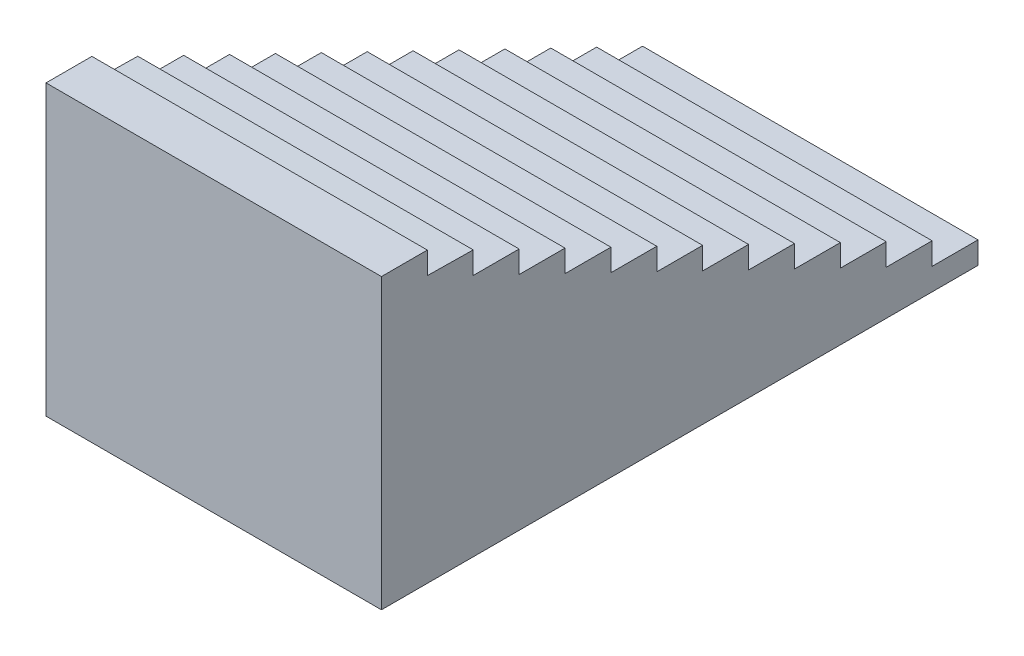
ISO-10303-21;
HEADER;
FILE_DESCRIPTION(('STEP AP214'),'2;1');
FILE_NAME('part.step','',(''),(''),'','','');
FILE_SCHEMA(('AUTOMOTIVE_DESIGN { 1 0 10303 214 1 1 1 1 }'));
ENDSEC;
DATA;
#1=APPLICATION_CONTEXT('core data for automotive mechanical design processes');
#2=APPLICATION_PROTOCOL_DEFINITION('international standard','automotive_design',2000,#1);
#3=PRODUCT_CONTEXT('',#1,'mechanical');
#4=PRODUCT('Part','Part','',(#3));
#5=PRODUCT_RELATED_PRODUCT_CATEGORY('part','',(#4));
#6=PRODUCT_DEFINITION_FORMATION('','',#4);
#7=PRODUCT_DEFINITION_CONTEXT('part definition',#1,'design');
#8=PRODUCT_DEFINITION('design','',#6,#7);
#9=PRODUCT_DEFINITION_SHAPE('','',#8);
#10=(LENGTH_UNIT() NAMED_UNIT(*) SI_UNIT(.MILLI.,.METRE.));
#11=(NAMED_UNIT(*) PLANE_ANGLE_UNIT() SI_UNIT($,.RADIAN.));
#12=(NAMED_UNIT(*) SI_UNIT($,.STERADIAN.) SOLID_ANGLE_UNIT());
#13=UNCERTAINTY_MEASURE_WITH_UNIT(LENGTH_MEASURE(1.E-05),#10,'distance_accuracy_value','');
#14=(GEOMETRIC_REPRESENTATION_CONTEXT(3) GLOBAL_UNCERTAINTY_ASSIGNED_CONTEXT((#13)) GLOBAL_UNIT_ASSIGNED_CONTEXT((#10,
#11,#12)) REPRESENTATION_CONTEXT('',''));
#15=CARTESIAN_POINT('',(0.,0.,0.));
#16=DIRECTION('',(0.,0.,1.));
#17=DIRECTION('',(1.,0.,0.));
#18=AXIS2_PLACEMENT_3D('',#15,#16,#17);
#19=CARTESIAN_POINT('',(-2120.,195.213145770368,60.));
#20=DIRECTION('',(0.,0.,-1.));
#21=DIRECTION('',(0.,1.,0.));
#22=AXIS2_PLACEMENT_3D('',#19,#20,#21);
#23=PLANE('',#22);
#24=DIRECTION('',(0.,1.,0.));
#25=VECTOR('',#24,1.);
#26=CARTESIAN_POINT('',(0.,195.213145770368,60.));
#27=LINE('',#26,#25);
#28=CARTESIAN_POINT('',(0.,55.2131457703675,60.));
#29=VERTEX_POINT('',#28);
#30=CARTESIAN_POINT('',(0.,195.213145770368,60.));
#31=VERTEX_POINT('',#30);
#32=EDGE_CURVE('E262',#29,#31,#27,.T.);
#33=ORIENTED_EDGE('',*,*,#32,.F.);
#34=DIRECTION('',(1.,0.,0.));
#35=VECTOR('',#34,1.);
#36=CARTESIAN_POINT('',(-2120.,55.2131457703675,60.));
#37=LINE('',#36,#35);
#38=CARTESIAN_POINT('',(-2120.,55.2131457703675,60.));
#39=VERTEX_POINT('',#38);
#40=EDGE_CURVE('E11',#39,#29,#37,.T.);
#41=ORIENTED_EDGE('',*,*,#40,.F.);
#42=DIRECTION('',(0.,1.,0.));
#43=VECTOR('',#42,1.);
#44=CARTESIAN_POINT('',(-2120.,195.213145770368,60.));
#45=LINE('',#44,#43);
#46=CARTESIAN_POINT('',(-2120.,195.213145770368,60.));
#47=VERTEX_POINT('',#46);
#48=EDGE_CURVE('E370',#39,#47,#45,.T.);
#49=ORIENTED_EDGE('',*,*,#48,.T.);
#50=DIRECTION('',(1.,0.,0.));
#51=VECTOR('',#50,1.);
#52=CARTESIAN_POINT('',(-2120.,195.213145770368,60.));
#53=LINE('',#52,#51);
#54=EDGE_CURVE('E42',#47,#31,#53,.T.);
#55=ORIENTED_EDGE('',*,*,#54,.T.);
#56=EDGE_LOOP('',(#33,#41,#49,#55));
#57=FACE_BOUND('',#56,.T.);
#58=ADVANCED_FACE('F39',(#57),#23,.T.);
#59=CARTESIAN_POINT('',(-2120.,55.2131457703675,60.));
#60=DIRECTION('',(0.,0.99989905724305,-0.0142082836563894));
#61=DIRECTION('',(0.,0.0142082836563894,0.99989905724305));
#62=AXIS2_PLACEMENT_3D('',#59,#60,#61);
#63=PLANE('',#62);
#64=DIRECTION('',(0.,0.0142082836563894,0.99989905724305));
#65=VECTOR('',#64,1.);
#66=CARTESIAN_POINT('',(0.,55.2131457703675,60.));
#67=LINE('',#66,#65);
#68=CARTESIAN_POINT('',(0.,51.0927435100146,-229.970726600484));
#69=VERTEX_POINT('',#68);
#70=EDGE_CURVE('E367',#69,#29,#67,.T.);
#71=ORIENTED_EDGE('',*,*,#70,.F.);
#72=DIRECTION('',(1.,0.,0.));
#73=VECTOR('',#72,1.);
#74=CARTESIAN_POINT('',(-2120.,51.0927435100146,-229.970726600484));
#75=LINE('',#74,#73);
#76=CARTESIAN_POINT('',(-2120.,51.0927435100146,-229.970726600484));
#77=VERTEX_POINT('',#76);
#78=EDGE_CURVE('E49',#77,#69,#75,.T.);
#79=ORIENTED_EDGE('',*,*,#78,.F.);
#80=DIRECTION('',(0.,0.0142082836563894,0.99989905724305));
#81=VECTOR('',#80,1.);
#82=CARTESIAN_POINT('',(-2120.,55.2131457703675,60.));
#83=LINE('',#82,#81);
#84=EDGE_CURVE('E248',#77,#39,#83,.T.);
#85=ORIENTED_EDGE('',*,*,#84,.T.);
#86=ORIENTED_EDGE('',*,*,#40,.T.);
#87=EDGE_LOOP('',(#71,#79,#85,#86));
#88=FACE_BOUND('',#87,.T.);
#89=ADVANCED_FACE('F448',(#88),#63,.T.);
#90=CARTESIAN_POINT('',(-2120.,51.0927435100146,-229.970726600484));
#91=DIRECTION('',(0.,0.,-1.));
#92=DIRECTION('',(0.,1.,0.));
#93=AXIS2_PLACEMENT_3D('',#90,#91,#92);
#94=PLANE('',#93);
#95=DIRECTION('',(0.,1.,0.));
#96=VECTOR('',#95,1.);
#97=CARTESIAN_POINT('',(0.,51.0927435100146,-229.970726600484));
#98=LINE('',#97,#96);
#99=CARTESIAN_POINT('',(0.,-88.9072564899854,-229.970726600484));
#100=VERTEX_POINT('',#99);
#101=EDGE_CURVE('E234',#100,#69,#98,.T.);
#102=ORIENTED_EDGE('',*,*,#101,.F.);
#103=DIRECTION('',(1.,0.,0.));
#104=VECTOR('',#103,1.);
#105=CARTESIAN_POINT('',(-2120.,-88.9072564899854,-229.970726600484));
#106=LINE('',#105,#104);
#107=CARTESIAN_POINT('',(-2120.,-88.9072564899854,-229.970726600484));
#108=VERTEX_POINT('',#107);
#109=EDGE_CURVE('E229',#108,#100,#106,.T.);
#110=ORIENTED_EDGE('',*,*,#109,.F.);
#111=DIRECTION('',(0.,1.,0.));
#112=VECTOR('',#111,1.);
#113=CARTESIAN_POINT('',(-2120.,51.0927435100146,-229.970726600484));
#114=LINE('',#113,#112);
#115=EDGE_CURVE('E232',#108,#77,#114,.T.);
#116=ORIENTED_EDGE('',*,*,#115,.T.);
#117=ORIENTED_EDGE('',*,*,#78,.T.);
#118=EDGE_LOOP('',(#102,#110,#116,#117));
#119=FACE_BOUND('',#118,.T.);
#120=ADVANCED_FACE('F231',(#119),#94,.T.);
#121=CARTESIAN_POINT('',(-2120.,-88.9072564899854,-229.970726600484));
#122=DIRECTION('',(0.,1.,0.));
#123=DIRECTION('',(0.,0.,1.));
#124=AXIS2_PLACEMENT_3D('',#121,#122,#123);
#125=PLANE('',#124);
#126=DIRECTION('',(0.,0.,1.));
#127=VECTOR('',#126,1.);
#128=CARTESIAN_POINT('',(0.,-88.9072564899854,-229.970726600484));
#129=LINE('',#128,#127);
#130=CARTESIAN_POINT('',(0.,-88.9072564899854,-519.970726600484));
#131=VERTEX_POINT('',#130);
#132=EDGE_CURVE('E362',#131,#100,#129,.T.);
#133=ORIENTED_EDGE('',*,*,#132,.F.);
#134=DIRECTION('',(1.,0.,0.));
#135=VECTOR('',#134,1.);
#136=CARTESIAN_POINT('',(-2120.,-88.9072564899854,-519.970726600484));
#137=LINE('',#136,#135);
#138=CARTESIAN_POINT('',(-2120.,-88.9072564899854,-519.970726600484));
#139=VERTEX_POINT('',#138);
#140=EDGE_CURVE('E240',#139,#131,#137,.T.);
#141=ORIENTED_EDGE('',*,*,#140,.F.);
#142=DIRECTION('',(0.,0.,1.));
#143=VECTOR('',#142,1.);
#144=CARTESIAN_POINT('',(-2120.,-88.9072564899854,-229.970726600484));
#145=LINE('',#144,#143);
#146=EDGE_CURVE('E246',#139,#108,#145,.T.);
#147=ORIENTED_EDGE('',*,*,#146,.T.);
#148=ORIENTED_EDGE('',*,*,#109,.T.);
#149=EDGE_LOOP('',(#133,#141,#147,#148));
#150=FACE_BOUND('',#149,.T.);
#151=ADVANCED_FACE('F251',(#150),#125,.T.);
#152=CARTESIAN_POINT('',(-2120.,-88.9072564899854,-519.970726600484));
#153=DIRECTION('',(0.,0.,-1.));
#154=DIRECTION('',(-1.,0.,0.));
#155=AXIS2_PLACEMENT_3D('',#152,#153,#154);
#156=PLANE('',#155);
#157=DIRECTION('',(0.,1.,0.));
#158=VECTOR('',#157,1.);
#159=CARTESIAN_POINT('',(0.,-88.9072564899854,-519.970726600484));
#160=LINE('',#159,#158);
#161=CARTESIAN_POINT('',(0.,-228.907256489985,-519.970726600484));
#162=VERTEX_POINT('',#161);
#163=EDGE_CURVE('E358',#162,#131,#160,.T.);
#164=ORIENTED_EDGE('',*,*,#163,.F.);
#165=DIRECTION('',(1.,0.,0.));
#166=VECTOR('',#165,1.);
#167=CARTESIAN_POINT('',(-2120.,-228.907256489985,-519.970726600484));
#168=LINE('',#167,#166);
#169=CARTESIAN_POINT('',(-2120.,-228.907256489985,-519.970726600484));
#170=VERTEX_POINT('',#169);
#171=EDGE_CURVE('E376',#170,#162,#168,.T.);
#172=ORIENTED_EDGE('',*,*,#171,.F.);
#173=DIRECTION('',(0.,1.,0.));
#174=VECTOR('',#173,1.);
#175=CARTESIAN_POINT('',(-2120.,-88.9072564899854,-519.970726600484));
#176=LINE('',#175,#174);
#177=EDGE_CURVE('E253',#170,#139,#176,.T.);
#178=ORIENTED_EDGE('',*,*,#177,.T.);
#179=ORIENTED_EDGE('',*,*,#140,.T.);
#180=EDGE_LOOP('',(#164,#172,#178,#179));
#181=FACE_BOUND('',#180,.T.);
#182=ADVANCED_FACE('F461',(#181),#156,.T.);
#183=CARTESIAN_POINT('',(-2120.,-228.907256489985,-519.970726600484));
#184=DIRECTION('',(0.,1.,0.));
#185=DIRECTION('',(0.,0.,1.));
#186=AXIS2_PLACEMENT_3D('',#183,#184,#185);
#187=PLANE('',#186);
#188=DIRECTION('',(0.,0.,1.));
#189=VECTOR('',#188,1.);
#190=CARTESIAN_POINT('',(0.,-228.907256489985,-519.970726600484));
#191=LINE('',#190,#189);
#192=CARTESIAN_POINT('',(0.,-228.907256489985,-809.970726600485));
#193=VERTEX_POINT('',#192);
#194=EDGE_CURVE('E354',#193,#162,#191,.T.);
#195=ORIENTED_EDGE('',*,*,#194,.F.);
#196=DIRECTION('',(1.,0.,0.));
#197=VECTOR('',#196,1.);
#198=CARTESIAN_POINT('',(-2120.,-228.907256489985,-809.970726600485));
#199=LINE('',#198,#197);
#200=CARTESIAN_POINT('',(-2120.,-228.907256489985,-809.970726600485));
#201=VERTEX_POINT('',#200);
#202=EDGE_CURVE('E379',#201,#193,#199,.T.);
#203=ORIENTED_EDGE('',*,*,#202,.F.);
#204=DIRECTION('',(0.,0.,1.));
#205=VECTOR('',#204,1.);
#206=CARTESIAN_POINT('',(-2120.,-228.907256489985,-519.970726600484));
#207=LINE('',#206,#205);
#208=EDGE_CURVE('E256',#201,#170,#207,.T.);
#209=ORIENTED_EDGE('',*,*,#208,.T.);
#210=ORIENTED_EDGE('',*,*,#171,.T.);
#211=EDGE_LOOP('',(#195,#203,#209,#210));
#212=FACE_BOUND('',#211,.T.);
#213=ADVANCED_FACE('F464',(#212),#187,.T.);
#214=CARTESIAN_POINT('',(-2120.,-228.907256489985,-809.970726600485));
#215=DIRECTION('',(0.,0.,-1.));
#216=DIRECTION('',(0.,1.,0.));
#217=AXIS2_PLACEMENT_3D('',#214,#215,#216);
#218=PLANE('',#217);
#219=DIRECTION('',(0.,1.,0.));
#220=VECTOR('',#219,1.);
#221=CARTESIAN_POINT('',(0.,-228.907256489985,-809.970726600485));
#222=LINE('',#221,#220);
#223=CARTESIAN_POINT('',(0.,-368.907256489985,-809.970726600484));
#224=VERTEX_POINT('',#223);
#225=EDGE_CURVE('E350',#224,#193,#222,.T.);
#226=ORIENTED_EDGE('',*,*,#225,.F.);
#227=DIRECTION('',(1.,0.,0.));
#228=VECTOR('',#227,1.);
#229=CARTESIAN_POINT('',(-2120.,-368.907256489985,-809.970726600484));
#230=LINE('',#229,#228);
#231=CARTESIAN_POINT('',(-2120.,-368.907256489985,-809.970726600484));
#232=VERTEX_POINT('',#231);
#233=EDGE_CURVE('E382',#232,#224,#230,.T.);
#234=ORIENTED_EDGE('',*,*,#233,.F.);
#235=DIRECTION('',(0.,1.,0.));
#236=VECTOR('',#235,1.);
#237=CARTESIAN_POINT('',(-2120.,-228.907256489985,-809.970726600485));
#238=LINE('',#237,#236);
#239=EDGE_CURVE('E809',#232,#201,#238,.T.);
#240=ORIENTED_EDGE('',*,*,#239,.T.);
#241=ORIENTED_EDGE('',*,*,#202,.T.);
#242=EDGE_LOOP('',(#226,#234,#240,#241));
#243=FACE_BOUND('',#242,.T.);
#244=ADVANCED_FACE('F468',(#243),#218,.T.);
#245=CARTESIAN_POINT('',(-2120.,-368.907256489985,-809.970726600484));
#246=DIRECTION('',(0.,1.,0.));
#247=DIRECTION('',(0.,0.,1.));
#248=AXIS2_PLACEMENT_3D('',#245,#246,#247);
#249=PLANE('',#248);
#250=DIRECTION('',(0.,0.,1.));
#251=VECTOR('',#250,1.);
#252=CARTESIAN_POINT('',(0.,-368.907256489985,-809.970726600484));
#253=LINE('',#252,#251);
#254=CARTESIAN_POINT('',(0.,-368.907256489985,-1099.97072660048));
#255=VERTEX_POINT('',#254);
#256=EDGE_CURVE('E346',#255,#224,#253,.T.);
#257=ORIENTED_EDGE('',*,*,#256,.F.);
#258=DIRECTION('',(1.,0.,0.));
#259=VECTOR('',#258,1.);
#260=CARTESIAN_POINT('',(-2120.,-368.907256489985,-1099.97072660048));
#261=LINE('',#260,#259);
#262=CARTESIAN_POINT('',(-2120.,-368.907256489985,-1099.97072660048));
#263=VERTEX_POINT('',#262);
#264=EDGE_CURVE('E385',#263,#255,#261,.T.);
#265=ORIENTED_EDGE('',*,*,#264,.F.);
#266=DIRECTION('',(0.,0.,1.));
#267=VECTOR('',#266,1.);
#268=CARTESIAN_POINT('',(-2120.,-368.907256489985,-809.970726600484));
#269=LINE('',#268,#267);
#270=EDGE_CURVE('E805',#263,#232,#269,.T.);
#271=ORIENTED_EDGE('',*,*,#270,.T.);
#272=ORIENTED_EDGE('',*,*,#233,.T.);
#273=EDGE_LOOP('',(#257,#265,#271,#272));
#274=FACE_BOUND('',#273,.T.);
#275=ADVANCED_FACE('F472',(#274),#249,.T.);
#276=CARTESIAN_POINT('',(-2120.,-368.907256489985,-1099.97072660048));
#277=DIRECTION('',(0.,0.,-1.));
#278=DIRECTION('',(-1.,0.,0.));
#279=AXIS2_PLACEMENT_3D('',#276,#277,#278);
#280=PLANE('',#279);
#281=DIRECTION('',(0.,1.,0.));
#282=VECTOR('',#281,1.);
#283=CARTESIAN_POINT('',(0.,-368.907256489985,-1099.97072660048));
#284=LINE('',#283,#282);
#285=CARTESIAN_POINT('',(0.,-508.907256489985,-1099.97072660048));
#286=VERTEX_POINT('',#285);
#287=EDGE_CURVE('E342',#286,#255,#284,.T.);
#288=ORIENTED_EDGE('',*,*,#287,.F.);
#289=DIRECTION('',(1.,0.,0.));
#290=VECTOR('',#289,1.);
#291=CARTESIAN_POINT('',(-2120.,-508.907256489985,-1099.97072660048));
#292=LINE('',#291,#290);
#293=CARTESIAN_POINT('',(-2120.,-508.907256489985,-1099.97072660048));
#294=VERTEX_POINT('',#293);
#295=EDGE_CURVE('E388',#294,#286,#292,.T.);
#296=ORIENTED_EDGE('',*,*,#295,.F.);
#297=DIRECTION('',(0.,1.,0.));
#298=VECTOR('',#297,1.);
#299=CARTESIAN_POINT('',(-2120.,-368.907256489985,-1099.97072660048));
#300=LINE('',#299,#298);
#301=EDGE_CURVE('E819',#294,#263,#300,.T.);
#302=ORIENTED_EDGE('',*,*,#301,.T.);
#303=ORIENTED_EDGE('',*,*,#264,.T.);
#304=EDGE_LOOP('',(#288,#296,#302,#303));
#305=FACE_BOUND('',#304,.T.);
#306=ADVANCED_FACE('F476',(#305),#280,.T.);
#307=CARTESIAN_POINT('',(-2120.,-508.907256489985,-1099.97072660048));
#308=DIRECTION('',(0.,1.,0.));
#309=DIRECTION('',(0.,0.,1.));
#310=AXIS2_PLACEMENT_3D('',#307,#308,#309);
#311=PLANE('',#310);
#312=DIRECTION('',(0.,0.,1.));
#313=VECTOR('',#312,1.);
#314=CARTESIAN_POINT('',(0.,-508.907256489985,-1099.97072660048));
#315=LINE('',#314,#313);
#316=CARTESIAN_POINT('',(0.,-508.907256489985,-1389.97072660048));
#317=VERTEX_POINT('',#316);
#318=EDGE_CURVE('E338',#317,#286,#315,.T.);
#319=ORIENTED_EDGE('',*,*,#318,.F.);
#320=DIRECTION('',(1.,0.,0.));
#321=VECTOR('',#320,1.);
#322=CARTESIAN_POINT('',(-2120.,-508.907256489985,-1389.97072660048));
#323=LINE('',#322,#321);
#324=CARTESIAN_POINT('',(-2120.,-508.907256489985,-1389.97072660048));
#325=VERTEX_POINT('',#324);
#326=EDGE_CURVE('E391',#325,#317,#323,.T.);
#327=ORIENTED_EDGE('',*,*,#326,.F.);
#328=DIRECTION('',(0.,0.,1.));
#329=VECTOR('',#328,1.);
#330=CARTESIAN_POINT('',(-2120.,-508.907256489985,-1099.97072660048));
#331=LINE('',#330,#329);
#332=EDGE_CURVE('E798',#325,#294,#331,.T.);
#333=ORIENTED_EDGE('',*,*,#332,.T.);
#334=ORIENTED_EDGE('',*,*,#295,.T.);
#335=EDGE_LOOP('',(#319,#327,#333,#334));
#336=FACE_BOUND('',#335,.T.);
#337=ADVANCED_FACE('F480',(#336),#311,.T.);
#338=CARTESIAN_POINT('',(-2120.,-508.907256489985,-1389.97072660048));
#339=DIRECTION('',(0.,0.,-1.));
#340=DIRECTION('',(0.,1.,0.));
#341=AXIS2_PLACEMENT_3D('',#338,#339,#340);
#342=PLANE('',#341);
#343=DIRECTION('',(0.,1.,0.));
#344=VECTOR('',#343,1.);
#345=CARTESIAN_POINT('',(0.,-508.907256489985,-1389.97072660048));
#346=LINE('',#345,#344);
#347=CARTESIAN_POINT('',(0.,-648.907256489985,-1389.97072660048));
#348=VERTEX_POINT('',#347);
#349=EDGE_CURVE('E334',#348,#317,#346,.T.);
#350=ORIENTED_EDGE('',*,*,#349,.F.);
#351=DIRECTION('',(1.,0.,0.));
#352=VECTOR('',#351,1.);
#353=CARTESIAN_POINT('',(-2120.,-648.907256489985,-1389.97072660048));
#354=LINE('',#353,#352);
#355=CARTESIAN_POINT('',(-2120.,-648.907256489985,-1389.97072660048));
#356=VERTEX_POINT('',#355);
#357=EDGE_CURVE('E394',#356,#348,#354,.T.);
#358=ORIENTED_EDGE('',*,*,#357,.F.);
#359=DIRECTION('',(0.,1.,0.));
#360=VECTOR('',#359,1.);
#361=CARTESIAN_POINT('',(-2120.,-508.907256489985,-1389.97072660048));
#362=LINE('',#361,#360);
#363=EDGE_CURVE('E794',#356,#325,#362,.T.);
#364=ORIENTED_EDGE('',*,*,#363,.T.);
#365=ORIENTED_EDGE('',*,*,#326,.T.);
#366=EDGE_LOOP('',(#350,#358,#364,#365));
#367=FACE_BOUND('',#366,.T.);
#368=ADVANCED_FACE('F484',(#367),#342,.T.);
#369=CARTESIAN_POINT('',(-2120.,-648.907256489985,-1389.97072660048));
#370=DIRECTION('',(0.,1.,0.));
#371=DIRECTION('',(0.,0.,1.));
#372=AXIS2_PLACEMENT_3D('',#369,#370,#371);
#373=PLANE('',#372);
#374=DIRECTION('',(0.,0.,1.));
#375=VECTOR('',#374,1.);
#376=CARTESIAN_POINT('',(0.,-648.907256489985,-1389.97072660048));
#377=LINE('',#376,#375);
#378=CARTESIAN_POINT('',(0.,-648.907256489985,-1679.97072660048));
#379=VERTEX_POINT('',#378);
#380=EDGE_CURVE('E330',#379,#348,#377,.T.);
#381=ORIENTED_EDGE('',*,*,#380,.F.);
#382=DIRECTION('',(1.,0.,0.));
#383=VECTOR('',#382,1.);
#384=CARTESIAN_POINT('',(-2120.,-648.907256489985,-1679.97072660048));
#385=LINE('',#384,#383);
#386=CARTESIAN_POINT('',(-2120.,-648.907256489985,-1679.97072660048));
#387=VERTEX_POINT('',#386);
#388=EDGE_CURVE('E397',#387,#379,#385,.T.);
#389=ORIENTED_EDGE('',*,*,#388,.F.);
#390=DIRECTION('',(0.,0.,1.));
#391=VECTOR('',#390,1.);
#392=CARTESIAN_POINT('',(-2120.,-648.907256489985,-1389.97072660048));
#393=LINE('',#392,#391);
#394=EDGE_CURVE('E826',#387,#356,#393,.T.);
#395=ORIENTED_EDGE('',*,*,#394,.T.);
#396=ORIENTED_EDGE('',*,*,#357,.T.);
#397=EDGE_LOOP('',(#381,#389,#395,#396));
#398=FACE_BOUND('',#397,.T.);
#399=ADVANCED_FACE('F488',(#398),#373,.T.);
#400=CARTESIAN_POINT('',(-2120.,-648.907256489985,-1679.97072660048));
#401=DIRECTION('',(0.,0.,-1.));
#402=DIRECTION('',(-1.,0.,0.));
#403=AXIS2_PLACEMENT_3D('',#400,#401,#402);
#404=PLANE('',#403);
#405=DIRECTION('',(0.,1.,0.));
#406=VECTOR('',#405,1.);
#407=CARTESIAN_POINT('',(0.,-648.907256489985,-1679.97072660048));
#408=LINE('',#407,#406);
#409=CARTESIAN_POINT('',(0.,-788.907256489985,-1679.97072660048));
#410=VERTEX_POINT('',#409);
#411=EDGE_CURVE('E326',#410,#379,#408,.T.);
#412=ORIENTED_EDGE('',*,*,#411,.F.);
#413=DIRECTION('',(1.,0.,0.));
#414=VECTOR('',#413,1.);
#415=CARTESIAN_POINT('',(-2120.,-788.907256489985,-1679.97072660048));
#416=LINE('',#415,#414);
#417=CARTESIAN_POINT('',(-2120.,-788.907256489985,-1679.97072660048));
#418=VERTEX_POINT('',#417);
#419=EDGE_CURVE('E400',#418,#410,#416,.T.);
#420=ORIENTED_EDGE('',*,*,#419,.F.);
#421=DIRECTION('',(0.,1.,0.));
#422=VECTOR('',#421,1.);
#423=CARTESIAN_POINT('',(-2120.,-648.907256489985,-1679.97072660048));
#424=LINE('',#423,#422);
#425=EDGE_CURVE('E787',#418,#387,#424,.T.);
#426=ORIENTED_EDGE('',*,*,#425,.T.);
#427=ORIENTED_EDGE('',*,*,#388,.T.);
#428=EDGE_LOOP('',(#412,#420,#426,#427));
#429=FACE_BOUND('',#428,.T.);
#430=ADVANCED_FACE('F492',(#429),#404,.T.);
#431=CARTESIAN_POINT('',(-2120.,-788.907256489985,-1679.97072660048));
#432=DIRECTION('',(0.,1.,0.));
#433=DIRECTION('',(0.,0.,1.));
#434=AXIS2_PLACEMENT_3D('',#431,#432,#433);
#435=PLANE('',#434);
#436=DIRECTION('',(0.,0.,1.));
#437=VECTOR('',#436,1.);
#438=CARTESIAN_POINT('',(0.,-788.907256489985,-1679.97072660048));
#439=LINE('',#438,#437);
#440=CARTESIAN_POINT('',(0.,-788.907256489985,-1969.97072660048));
#441=VERTEX_POINT('',#440);
#442=EDGE_CURVE('E322',#441,#410,#439,.T.);
#443=ORIENTED_EDGE('',*,*,#442,.F.);
#444=DIRECTION('',(1.,0.,0.));
#445=VECTOR('',#444,1.);
#446=CARTESIAN_POINT('',(-2120.,-788.907256489985,-1969.97072660048));
#447=LINE('',#446,#445);
#448=CARTESIAN_POINT('',(-2120.,-788.907256489985,-1969.97072660048));
#449=VERTEX_POINT('',#448);
#450=EDGE_CURVE('E403',#449,#441,#447,.T.);
#451=ORIENTED_EDGE('',*,*,#450,.F.);
#452=DIRECTION('',(0.,0.,1.));
#453=VECTOR('',#452,1.);
#454=CARTESIAN_POINT('',(-2120.,-788.907256489985,-1679.97072660048));
#455=LINE('',#454,#453);
#456=EDGE_CURVE('E783',#449,#418,#455,.T.);
#457=ORIENTED_EDGE('',*,*,#456,.T.);
#458=ORIENTED_EDGE('',*,*,#419,.T.);
#459=EDGE_LOOP('',(#443,#451,#457,#458));
#460=FACE_BOUND('',#459,.T.);
#461=ADVANCED_FACE('F496',(#460),#435,.T.);
#462=CARTESIAN_POINT('',(-2120.,-788.907256489985,-1969.97072660048));
#463=DIRECTION('',(0.,0.,-1.));
#464=DIRECTION('',(0.,1.,0.));
#465=AXIS2_PLACEMENT_3D('',#462,#463,#464);
#466=PLANE('',#465);
#467=DIRECTION('',(0.,1.,0.));
#468=VECTOR('',#467,1.);
#469=CARTESIAN_POINT('',(0.,-788.907256489985,-1969.97072660048));
#470=LINE('',#469,#468);
#471=CARTESIAN_POINT('',(0.,-928.907256489985,-1969.97072660048));
#472=VERTEX_POINT('',#471);
#473=EDGE_CURVE('E318',#472,#441,#470,.T.);
#474=ORIENTED_EDGE('',*,*,#473,.F.);
#475=DIRECTION('',(1.,0.,0.));
#476=VECTOR('',#475,1.);
#477=CARTESIAN_POINT('',(-2120.,-928.907256489985,-1969.97072660048));
#478=LINE('',#477,#476);
#479=CARTESIAN_POINT('',(-2120.,-928.907256489985,-1969.97072660048));
#480=VERTEX_POINT('',#479);
#481=EDGE_CURVE('E406',#480,#472,#478,.T.);
#482=ORIENTED_EDGE('',*,*,#481,.F.);
#483=DIRECTION('',(0.,1.,0.));
#484=VECTOR('',#483,1.);
#485=CARTESIAN_POINT('',(-2120.,-788.907256489985,-1969.97072660048));
#486=LINE('',#485,#484);
#487=EDGE_CURVE('E833',#480,#449,#486,.T.);
#488=ORIENTED_EDGE('',*,*,#487,.T.);
#489=ORIENTED_EDGE('',*,*,#450,.T.);
#490=EDGE_LOOP('',(#474,#482,#488,#489));
#491=FACE_BOUND('',#490,.T.);
#492=ADVANCED_FACE('F500',(#491),#466,.T.);
#493=CARTESIAN_POINT('',(-2120.,-928.907256489985,-1969.97072660048));
#494=DIRECTION('',(0.,1.,0.));
#495=DIRECTION('',(0.,0.,1.));
#496=AXIS2_PLACEMENT_3D('',#493,#494,#495);
#497=PLANE('',#496);
#498=DIRECTION('',(0.,0.,1.));
#499=VECTOR('',#498,1.);
#500=CARTESIAN_POINT('',(0.,-928.907256489985,-1969.97072660048));
#501=LINE('',#500,#499);
#502=CARTESIAN_POINT('',(0.,-928.907256489985,-2259.97072660048));
#503=VERTEX_POINT('',#502);
#504=EDGE_CURVE('E314',#503,#472,#501,.T.);
#505=ORIENTED_EDGE('',*,*,#504,.F.);
#506=DIRECTION('',(1.,0.,0.));
#507=VECTOR('',#506,1.);
#508=CARTESIAN_POINT('',(-2120.,-928.907256489985,-2259.97072660048));
#509=LINE('',#508,#507);
#510=CARTESIAN_POINT('',(-2120.,-928.907256489985,-2259.97072660048));
#511=VERTEX_POINT('',#510);
#512=EDGE_CURVE('E409',#511,#503,#509,.T.);
#513=ORIENTED_EDGE('',*,*,#512,.F.);
#514=DIRECTION('',(0.,0.,1.));
#515=VECTOR('',#514,1.);
#516=CARTESIAN_POINT('',(-2120.,-928.907256489985,-1969.97072660048));
#517=LINE('',#516,#515);
#518=EDGE_CURVE('E776',#511,#480,#517,.T.);
#519=ORIENTED_EDGE('',*,*,#518,.T.);
#520=ORIENTED_EDGE('',*,*,#481,.T.);
#521=EDGE_LOOP('',(#505,#513,#519,#520));
#522=FACE_BOUND('',#521,.T.);
#523=ADVANCED_FACE('F504',(#522),#497,.T.);
#524=CARTESIAN_POINT('',(-2120.,-928.907256489985,-2259.97072660048));
#525=DIRECTION('',(0.,0.,-1.));
#526=DIRECTION('',(-1.,0.,0.));
#527=AXIS2_PLACEMENT_3D('',#524,#525,#526);
#528=PLANE('',#527);
#529=DIRECTION('',(0.,1.,0.));
#530=VECTOR('',#529,1.);
#531=CARTESIAN_POINT('',(0.,-928.907256489985,-2259.97072660048));
#532=LINE('',#531,#530);
#533=CARTESIAN_POINT('',(0.,-1068.90725648999,-2259.97072660048));
#534=VERTEX_POINT('',#533);
#535=EDGE_CURVE('E310',#534,#503,#532,.T.);
#536=ORIENTED_EDGE('',*,*,#535,.F.);
#537=DIRECTION('',(1.,0.,0.));
#538=VECTOR('',#537,1.);
#539=CARTESIAN_POINT('',(-2120.,-1068.90725648999,-2259.97072660048));
#540=LINE('',#539,#538);
#541=CARTESIAN_POINT('',(-2120.,-1068.90725648999,-2259.97072660048));
#542=VERTEX_POINT('',#541);
#543=EDGE_CURVE('E412',#542,#534,#540,.T.);
#544=ORIENTED_EDGE('',*,*,#543,.F.);
#545=DIRECTION('',(0.,1.,0.));
#546=VECTOR('',#545,1.);
#547=CARTESIAN_POINT('',(-2120.,-928.907256489985,-2259.97072660048));
#548=LINE('',#547,#546);
#549=EDGE_CURVE('E772',#542,#511,#548,.T.);
#550=ORIENTED_EDGE('',*,*,#549,.T.);
#551=ORIENTED_EDGE('',*,*,#512,.T.);
#552=EDGE_LOOP('',(#536,#544,#550,#551));
#553=FACE_BOUND('',#552,.T.);
#554=ADVANCED_FACE('F508',(#553),#528,.T.);
#555=CARTESIAN_POINT('',(-2120.,-1068.90725648999,-2259.97072660048));
#556=DIRECTION('',(0.,1.,0.));
#557=DIRECTION('',(0.,0.,1.));
#558=AXIS2_PLACEMENT_3D('',#555,#556,#557);
#559=PLANE('',#558);
#560=DIRECTION('',(0.,0.,1.));
#561=VECTOR('',#560,1.);
#562=CARTESIAN_POINT('',(0.,-1068.90725648999,-2259.97072660048));
#563=LINE('',#562,#561);
#564=CARTESIAN_POINT('',(0.,-1068.90725648999,-2549.97072660048));
#565=VERTEX_POINT('',#564);
#566=EDGE_CURVE('E306',#565,#534,#563,.T.);
#567=ORIENTED_EDGE('',*,*,#566,.F.);
#568=DIRECTION('',(1.,0.,0.));
#569=VECTOR('',#568,1.);
#570=CARTESIAN_POINT('',(-2120.,-1068.90725648999,-2549.97072660048));
#571=LINE('',#570,#569);
#572=CARTESIAN_POINT('',(-2120.,-1068.90725648999,-2549.97072660048));
#573=VERTEX_POINT('',#572);
#574=EDGE_CURVE('E415',#573,#565,#571,.T.);
#575=ORIENTED_EDGE('',*,*,#574,.F.);
#576=DIRECTION('',(0.,0.,1.));
#577=VECTOR('',#576,1.);
#578=CARTESIAN_POINT('',(-2120.,-1068.90725648999,-2259.97072660048));
#579=LINE('',#578,#577);
#580=EDGE_CURVE('E840',#573,#542,#579,.T.);
#581=ORIENTED_EDGE('',*,*,#580,.T.);
#582=ORIENTED_EDGE('',*,*,#543,.T.);
#583=EDGE_LOOP('',(#567,#575,#581,#582));
#584=FACE_BOUND('',#583,.T.);
#585=ADVANCED_FACE('F512',(#584),#559,.T.);
#586=CARTESIAN_POINT('',(-2120.,-1068.90725648999,-2549.97072660048));
#587=DIRECTION('',(0.,0.,-1.));
#588=DIRECTION('',(-1.,0.,0.));
#589=AXIS2_PLACEMENT_3D('',#586,#587,#588);
#590=PLANE('',#589);
#591=DIRECTION('',(0.,1.,0.));
#592=VECTOR('',#591,1.);
#593=CARTESIAN_POINT('',(0.,-1068.90725648999,-2549.97072660048));
#594=LINE('',#593,#592);
#595=CARTESIAN_POINT('',(0.,-1208.90725648999,-2549.97072660048));
#596=VERTEX_POINT('',#595);
#597=EDGE_CURVE('E302',#596,#565,#594,.T.);
#598=ORIENTED_EDGE('',*,*,#597,.F.);
#599=DIRECTION('',(1.,0.,0.));
#600=VECTOR('',#599,1.);
#601=CARTESIAN_POINT('',(-2120.,-1208.90725648999,-2549.97072660048));
#602=LINE('',#601,#600);
#603=CARTESIAN_POINT('',(-2120.,-1208.90725648999,-2549.97072660048));
#604=VERTEX_POINT('',#603);
#605=EDGE_CURVE('E418',#604,#596,#602,.T.);
#606=ORIENTED_EDGE('',*,*,#605,.F.);
#607=DIRECTION('',(0.,1.,0.));
#608=VECTOR('',#607,1.);
#609=CARTESIAN_POINT('',(-2120.,-1068.90725648999,-2549.97072660048));
#610=LINE('',#609,#608);
#611=EDGE_CURVE('E765',#604,#573,#610,.T.);
#612=ORIENTED_EDGE('',*,*,#611,.T.);
#613=ORIENTED_EDGE('',*,*,#574,.T.);
#614=EDGE_LOOP('',(#598,#606,#612,#613));
#615=FACE_BOUND('',#614,.T.);
#616=ADVANCED_FACE('F516',(#615),#590,.T.);
#617=CARTESIAN_POINT('',(-2120.,-1208.90725648999,-2549.97072660048));
#618=DIRECTION('',(0.,1.,0.));
#619=DIRECTION('',(0.,0.,1.));
#620=AXIS2_PLACEMENT_3D('',#617,#618,#619);
#621=PLANE('',#620);
#622=DIRECTION('',(0.,0.,1.));
#623=VECTOR('',#622,1.);
#624=CARTESIAN_POINT('',(0.,-1208.90725648999,-2549.97072660048));
#625=LINE('',#624,#623);
#626=CARTESIAN_POINT('',(0.,-1208.90725648999,-2839.97072660048));
#627=VERTEX_POINT('',#626);
#628=EDGE_CURVE('E298',#627,#596,#625,.T.);
#629=ORIENTED_EDGE('',*,*,#628,.F.);
#630=DIRECTION('',(1.,0.,0.));
#631=VECTOR('',#630,1.);
#632=CARTESIAN_POINT('',(-2120.,-1208.90725648999,-2839.97072660048));
#633=LINE('',#632,#631);
#634=CARTESIAN_POINT('',(-2120.,-1208.90725648999,-2839.97072660048));
#635=VERTEX_POINT('',#634);
#636=EDGE_CURVE('E421',#635,#627,#633,.T.);
#637=ORIENTED_EDGE('',*,*,#636,.F.);
#638=DIRECTION('',(0.,0.,1.));
#639=VECTOR('',#638,1.);
#640=CARTESIAN_POINT('',(-2120.,-1208.90725648999,-2549.97072660048));
#641=LINE('',#640,#639);
#642=EDGE_CURVE('E761',#635,#604,#641,.T.);
#643=ORIENTED_EDGE('',*,*,#642,.T.);
#644=ORIENTED_EDGE('',*,*,#605,.T.);
#645=EDGE_LOOP('',(#629,#637,#643,#644));
#646=FACE_BOUND('',#645,.T.);
#647=ADVANCED_FACE('F520',(#646),#621,.T.);
#648=CARTESIAN_POINT('',(-2120.,-1208.90725648999,-2839.97072660048));
#649=DIRECTION('',(0.,0.,-1.));
#650=DIRECTION('',(-1.,0.,0.));
#651=AXIS2_PLACEMENT_3D('',#648,#649,#650);
#652=PLANE('',#651);
#653=DIRECTION('',(0.,1.,0.));
#654=VECTOR('',#653,1.);
#655=CARTESIAN_POINT('',(0.,-1208.90725648999,-2839.97072660048));
#656=LINE('',#655,#654);
#657=CARTESIAN_POINT('',(0.,-1348.90725648998,-2839.97072660048));
#658=VERTEX_POINT('',#657);
#659=EDGE_CURVE('E294',#658,#627,#656,.T.);
#660=ORIENTED_EDGE('',*,*,#659,.F.);
#661=DIRECTION('',(1.,0.,0.));
#662=VECTOR('',#661,1.);
#663=CARTESIAN_POINT('',(-2120.,-1348.90725648998,-2839.97072660048));
#664=LINE('',#663,#662);
#665=CARTESIAN_POINT('',(-2120.,-1348.90725648998,-2839.97072660048));
#666=VERTEX_POINT('',#665);
#667=EDGE_CURVE('E424',#666,#658,#664,.T.);
#668=ORIENTED_EDGE('',*,*,#667,.F.);
#669=DIRECTION('',(0.,1.,0.));
#670=VECTOR('',#669,1.);
#671=CARTESIAN_POINT('',(-2120.,-1208.90725648999,-2839.97072660048));
#672=LINE('',#671,#670);
#673=EDGE_CURVE('E847',#666,#635,#672,.T.);
#674=ORIENTED_EDGE('',*,*,#673,.T.);
#675=ORIENTED_EDGE('',*,*,#636,.T.);
#676=EDGE_LOOP('',(#660,#668,#674,#675));
#677=FACE_BOUND('',#676,.T.);
#678=ADVANCED_FACE('F524',(#677),#652,.T.);
#679=CARTESIAN_POINT('',(-2120.,-1348.90725648998,-2839.97072660048));
#680=DIRECTION('',(0.,1.,0.));
#681=DIRECTION('',(0.,0.,1.));
#682=AXIS2_PLACEMENT_3D('',#679,#680,#681);
#683=PLANE('',#682);
#684=DIRECTION('',(0.,0.,1.));
#685=VECTOR('',#684,1.);
#686=CARTESIAN_POINT('',(0.,-1348.90725648998,-2839.97072660048));
#687=LINE('',#686,#685);
#688=CARTESIAN_POINT('',(0.,-1348.90725648998,-3129.97072660048));
#689=VERTEX_POINT('',#688);
#690=EDGE_CURVE('E290',#689,#658,#687,.T.);
#691=ORIENTED_EDGE('',*,*,#690,.F.);
#692=DIRECTION('',(1.,0.,0.));
#693=VECTOR('',#692,1.);
#694=CARTESIAN_POINT('',(-2120.,-1348.90725648998,-3129.97072660048));
#695=LINE('',#694,#693);
#696=CARTESIAN_POINT('',(-2120.,-1348.90725648998,-3129.97072660048));
#697=VERTEX_POINT('',#696);
#698=EDGE_CURVE('E427',#697,#689,#695,.T.);
#699=ORIENTED_EDGE('',*,*,#698,.F.);
#700=DIRECTION('',(0.,0.,1.));
#701=VECTOR('',#700,1.);
#702=CARTESIAN_POINT('',(-2120.,-1348.90725648998,-2839.97072660048));
#703=LINE('',#702,#701);
#704=EDGE_CURVE('E754',#697,#666,#703,.T.);
#705=ORIENTED_EDGE('',*,*,#704,.T.);
#706=ORIENTED_EDGE('',*,*,#667,.T.);
#707=EDGE_LOOP('',(#691,#699,#705,#706));
#708=FACE_BOUND('',#707,.T.);
#709=ADVANCED_FACE('F528',(#708),#683,.T.);
#710=CARTESIAN_POINT('',(-2120.,-1348.90725648998,-3129.97072660048));
#711=DIRECTION('',(0.,0.,-1.));
#712=DIRECTION('',(-1.,0.,0.));
#713=AXIS2_PLACEMENT_3D('',#710,#711,#712);
#714=PLANE('',#713);
#715=DIRECTION('',(0.,1.,0.));
#716=VECTOR('',#715,1.);
#717=CARTESIAN_POINT('',(0.,-1348.90725648998,-3129.97072660048));
#718=LINE('',#717,#716);
#719=CARTESIAN_POINT('',(0.,-1488.90725648999,-3129.97072660048));
#720=VERTEX_POINT('',#719);
#721=EDGE_CURVE('E286',#720,#689,#718,.T.);
#722=ORIENTED_EDGE('',*,*,#721,.F.);
#723=DIRECTION('',(1.,0.,0.));
#724=VECTOR('',#723,1.);
#725=CARTESIAN_POINT('',(-2120.,-1488.90725648999,-3129.97072660048));
#726=LINE('',#725,#724);
#727=CARTESIAN_POINT('',(-2120.,-1488.90725648999,-3129.97072660048));
#728=VERTEX_POINT('',#727);
#729=EDGE_CURVE('E430',#728,#720,#726,.T.);
#730=ORIENTED_EDGE('',*,*,#729,.F.);
#731=DIRECTION('',(0.,1.,0.));
#732=VECTOR('',#731,1.);
#733=CARTESIAN_POINT('',(-2120.,-1348.90725648998,-3129.97072660048));
#734=LINE('',#733,#732);
#735=EDGE_CURVE('E750',#728,#697,#734,.T.);
#736=ORIENTED_EDGE('',*,*,#735,.T.);
#737=ORIENTED_EDGE('',*,*,#698,.T.);
#738=EDGE_LOOP('',(#722,#730,#736,#737));
#739=FACE_BOUND('',#738,.T.);
#740=ADVANCED_FACE('F532',(#739),#714,.T.);
#741=CARTESIAN_POINT('',(-2120.,-1488.90725648999,-3129.97072660048));
#742=DIRECTION('',(0.,1.,0.));
#743=DIRECTION('',(0.,0.,1.));
#744=AXIS2_PLACEMENT_3D('',#741,#742,#743);
#745=PLANE('',#744);
#746=DIRECTION('',(0.,0.,1.));
#747=VECTOR('',#746,1.);
#748=CARTESIAN_POINT('',(0.,-1488.90725648999,-3129.97072660048));
#749=LINE('',#748,#747);
#750=CARTESIAN_POINT('',(0.,-1488.90725648998,-3419.97072660048));
#751=VERTEX_POINT('',#750);
#752=EDGE_CURVE('E282',#751,#720,#749,.T.);
#753=ORIENTED_EDGE('',*,*,#752,.F.);
#754=DIRECTION('',(1.,0.,0.));
#755=VECTOR('',#754,1.);
#756=CARTESIAN_POINT('',(-2120.,-1488.90725648998,-3419.97072660048));
#757=LINE('',#756,#755);
#758=CARTESIAN_POINT('',(-2120.,-1488.90725648998,-3419.97072660048));
#759=VERTEX_POINT('',#758);
#760=EDGE_CURVE('E433',#759,#751,#757,.T.);
#761=ORIENTED_EDGE('',*,*,#760,.F.);
#762=DIRECTION('',(0.,0.,1.));
#763=VECTOR('',#762,1.);
#764=CARTESIAN_POINT('',(-2120.,-1488.90725648999,-3129.97072660048));
#765=LINE('',#764,#763);
#766=EDGE_CURVE('E854',#759,#728,#765,.T.);
#767=ORIENTED_EDGE('',*,*,#766,.T.);
#768=ORIENTED_EDGE('',*,*,#729,.T.);
#769=EDGE_LOOP('',(#753,#761,#767,#768));
#770=FACE_BOUND('',#769,.T.);
#771=ADVANCED_FACE('F536',(#770),#745,.T.);
#772=CARTESIAN_POINT('',(-2120.,-1488.90725648998,-3419.97072660048));
#773=DIRECTION('',(0.,0.,-1.));
#774=DIRECTION('',(0.,1.,0.));
#775=AXIS2_PLACEMENT_3D('',#772,#773,#774);
#776=PLANE('',#775);
#777=DIRECTION('',(0.,1.,0.));
#778=VECTOR('',#777,1.);
#779=CARTESIAN_POINT('',(0.,-1488.90725648998,-3419.97072660048));
#780=LINE('',#779,#778);
#781=CARTESIAN_POINT('',(0.,-1628.90725648998,-3419.97072660048));
#782=VERTEX_POINT('',#781);
#783=EDGE_CURVE('E278',#782,#751,#780,.T.);
#784=ORIENTED_EDGE('',*,*,#783,.F.);
#785=DIRECTION('',(1.,0.,0.));
#786=VECTOR('',#785,1.);
#787=CARTESIAN_POINT('',(-2120.,-1628.90725648998,-3419.97072660048));
#788=LINE('',#787,#786);
#789=CARTESIAN_POINT('',(-2120.,-1628.90725648998,-3419.97072660048));
#790=VERTEX_POINT('',#789);
#791=EDGE_CURVE('E436',#790,#782,#788,.T.);
#792=ORIENTED_EDGE('',*,*,#791,.F.);
#793=DIRECTION('',(0.,1.,0.));
#794=VECTOR('',#793,1.);
#795=CARTESIAN_POINT('',(-2120.,-1488.90725648998,-3419.97072660048));
#796=LINE('',#795,#794);
#797=EDGE_CURVE('E743',#790,#759,#796,.T.);
#798=ORIENTED_EDGE('',*,*,#797,.T.);
#799=ORIENTED_EDGE('',*,*,#760,.T.);
#800=EDGE_LOOP('',(#784,#792,#798,#799));
#801=FACE_BOUND('',#800,.T.);
#802=ADVANCED_FACE('F540',(#801),#776,.T.);
#803=CARTESIAN_POINT('',(-2120.,-1628.90725648998,350.));
#804=DIRECTION('',(0.,-1.,0.));
#805=DIRECTION('',(0.,0.,-1.));
#806=AXIS2_PLACEMENT_3D('',#803,#804,#805);
#807=PLANE('',#806);
#808=DIRECTION('',(0.,0.,-1.));
#809=VECTOR('',#808,1.);
#810=CARTESIAN_POINT('',(0.,-1628.90725648998,350.));
#811=LINE('',#810,#809);
#812=CARTESIAN_POINT('',(0.,-1628.90725648998,350.));
#813=VERTEX_POINT('',#812);
#814=EDGE_CURVE('E274',#813,#782,#811,.T.);
#815=ORIENTED_EDGE('',*,*,#814,.F.);
#816=DIRECTION('',(1.,0.,0.));
#817=VECTOR('',#816,1.);
#818=CARTESIAN_POINT('',(-2120.,-1628.90725648998,350.));
#819=LINE('',#818,#817);
#820=CARTESIAN_POINT('',(-2120.,-1628.90725648998,350.));
#821=VERTEX_POINT('',#820);
#822=EDGE_CURVE('E439',#821,#813,#819,.T.);
#823=ORIENTED_EDGE('',*,*,#822,.F.);
#824=DIRECTION('',(0.,0.,-1.));
#825=VECTOR('',#824,1.);
#826=CARTESIAN_POINT('',(-2120.,-1628.90725648998,350.));
#827=LINE('',#826,#825);
#828=EDGE_CURVE('E739',#821,#790,#827,.T.);
#829=ORIENTED_EDGE('',*,*,#828,.T.);
#830=ORIENTED_EDGE('',*,*,#791,.T.);
#831=EDGE_LOOP('',(#815,#823,#829,#830));
#832=FACE_BOUND('',#831,.T.);
#833=ADVANCED_FACE('F544',(#832),#807,.T.);
#834=CARTESIAN_POINT('',(-2120.,195.213145770367,350.));
#835=DIRECTION('',(0.,0.,1.));
#836=DIRECTION('',(0.,-1.,0.));
#837=AXIS2_PLACEMENT_3D('',#834,#835,#836);
#838=PLANE('',#837);
#839=DIRECTION('',(0.,-1.,0.));
#840=VECTOR('',#839,1.);
#841=CARTESIAN_POINT('',(0.,195.213145770367,350.));
#842=LINE('',#841,#840);
#843=CARTESIAN_POINT('',(0.,195.213145770367,350.));
#844=VERTEX_POINT('',#843);
#845=EDGE_CURVE('E270',#844,#813,#842,.T.);
#846=ORIENTED_EDGE('',*,*,#845,.F.);
#847=DIRECTION('',(1.,0.,0.));
#848=VECTOR('',#847,1.);
#849=CARTESIAN_POINT('',(-2120.,195.213145770367,350.));
#850=LINE('',#849,#848);
#851=CARTESIAN_POINT('',(-2120.,195.213145770367,350.));
#852=VERTEX_POINT('',#851);
#853=EDGE_CURVE('E441',#852,#844,#850,.T.);
#854=ORIENTED_EDGE('',*,*,#853,.F.);
#855=DIRECTION('',(0.,-1.,0.));
#856=VECTOR('',#855,1.);
#857=CARTESIAN_POINT('',(-2120.,195.213145770367,350.));
#858=LINE('',#857,#856);
#859=EDGE_CURVE('E861',#852,#821,#858,.T.);
#860=ORIENTED_EDGE('',*,*,#859,.T.);
#861=ORIENTED_EDGE('',*,*,#822,.T.);
#862=EDGE_LOOP('',(#846,#854,#860,#861));
#863=FACE_BOUND('',#862,.T.);
#864=ADVANCED_FACE('F548',(#863),#838,.T.);
#865=CARTESIAN_POINT('',(-2120.,195.213145770367,350.));
#866=DIRECTION('',(0.,1.,0.));
#867=DIRECTION('',(0.,0.,1.));
#868=AXIS2_PLACEMENT_3D('',#865,#866,#867);
#869=PLANE('',#868);
#870=DIRECTION('',(0.,0.,1.));
#871=VECTOR('',#870,1.);
#872=CARTESIAN_POINT('',(0.,195.213145770367,350.));
#873=LINE('',#872,#871);
#874=EDGE_CURVE('E266',#31,#844,#873,.T.);
#875=ORIENTED_EDGE('',*,*,#874,.F.);
#876=ORIENTED_EDGE('',*,*,#54,.F.);
#877=DIRECTION('',(0.,0.,1.));
#878=VECTOR('',#877,1.);
#879=CARTESIAN_POINT('',(-2120.,195.213145770367,350.));
#880=LINE('',#879,#878);
#881=EDGE_CURVE('E864',#47,#852,#880,.T.);
#882=ORIENTED_EDGE('',*,*,#881,.T.);
#883=ORIENTED_EDGE('',*,*,#853,.T.);
#884=EDGE_LOOP('',(#875,#876,#882,#883));
#885=FACE_BOUND('',#884,.T.);
#886=ADVANCED_FACE('F445',(#885),#869,.T.);
#887=CARTESIAN_POINT('',(-2120.,0.,0.));
#888=DIRECTION('',(1.,0.,0.));
#889=DIRECTION('',(0.,0.,-1.));
#890=AXIS2_PLACEMENT_3D('',#887,#888,#889);
#891=PLANE('',#890);
#892=ORIENTED_EDGE('',*,*,#48,.F.);
#893=ORIENTED_EDGE('',*,*,#84,.F.);
#894=ORIENTED_EDGE('',*,*,#115,.F.);
#895=ORIENTED_EDGE('',*,*,#146,.F.);
#896=ORIENTED_EDGE('',*,*,#177,.F.);
#897=ORIENTED_EDGE('',*,*,#208,.F.);
#898=ORIENTED_EDGE('',*,*,#239,.F.);
#899=ORIENTED_EDGE('',*,*,#270,.F.);
#900=ORIENTED_EDGE('',*,*,#301,.F.);
#901=ORIENTED_EDGE('',*,*,#332,.F.);
#902=ORIENTED_EDGE('',*,*,#363,.F.);
#903=ORIENTED_EDGE('',*,*,#394,.F.);
#904=ORIENTED_EDGE('',*,*,#425,.F.);
#905=ORIENTED_EDGE('',*,*,#456,.F.);
#906=ORIENTED_EDGE('',*,*,#487,.F.);
#907=ORIENTED_EDGE('',*,*,#518,.F.);
#908=ORIENTED_EDGE('',*,*,#549,.F.);
#909=ORIENTED_EDGE('',*,*,#580,.F.);
#910=ORIENTED_EDGE('',*,*,#611,.F.);
#911=ORIENTED_EDGE('',*,*,#642,.F.);
#912=ORIENTED_EDGE('',*,*,#673,.F.);
#913=ORIENTED_EDGE('',*,*,#704,.F.);
#914=ORIENTED_EDGE('',*,*,#735,.F.);
#915=ORIENTED_EDGE('',*,*,#766,.F.);
#916=ORIENTED_EDGE('',*,*,#797,.F.);
#917=ORIENTED_EDGE('',*,*,#828,.F.);
#918=ORIENTED_EDGE('',*,*,#859,.F.);
#919=ORIENTED_EDGE('',*,*,#881,.F.);
#920=EDGE_LOOP('',(#892,#893,#894,#895,#896,#897,#898,#899,#900,#901,#902,#903,#904,#905,#906,
#907,#908,#909,#910,#911,#912,#913,#914,#915,#916,#917,#918,#919));
#921=FACE_BOUND('',#920,.T.);
#922=ADVANCED_FACE('F244',(#921),#891,.F.);
#923=CARTESIAN_POINT('',(0.,0.,0.));
#924=DIRECTION('',(1.,0.,0.));
#925=DIRECTION('',(0.,0.,-1.));
#926=AXIS2_PLACEMENT_3D('',#923,#924,#925);
#927=PLANE('',#926);
#928=ORIENTED_EDGE('',*,*,#32,.T.);
#929=ORIENTED_EDGE('',*,*,#874,.T.);
#930=ORIENTED_EDGE('',*,*,#845,.T.);
#931=ORIENTED_EDGE('',*,*,#814,.T.);
#932=ORIENTED_EDGE('',*,*,#783,.T.);
#933=ORIENTED_EDGE('',*,*,#752,.T.);
#934=ORIENTED_EDGE('',*,*,#721,.T.);
#935=ORIENTED_EDGE('',*,*,#690,.T.);
#936=ORIENTED_EDGE('',*,*,#659,.T.);
#937=ORIENTED_EDGE('',*,*,#628,.T.);
#938=ORIENTED_EDGE('',*,*,#597,.T.);
#939=ORIENTED_EDGE('',*,*,#566,.T.);
#940=ORIENTED_EDGE('',*,*,#535,.T.);
#941=ORIENTED_EDGE('',*,*,#504,.T.);
#942=ORIENTED_EDGE('',*,*,#473,.T.);
#943=ORIENTED_EDGE('',*,*,#442,.T.);
#944=ORIENTED_EDGE('',*,*,#411,.T.);
#945=ORIENTED_EDGE('',*,*,#380,.T.);
#946=ORIENTED_EDGE('',*,*,#349,.T.);
#947=ORIENTED_EDGE('',*,*,#318,.T.);
#948=ORIENTED_EDGE('',*,*,#287,.T.);
#949=ORIENTED_EDGE('',*,*,#256,.T.);
#950=ORIENTED_EDGE('',*,*,#225,.T.);
#951=ORIENTED_EDGE('',*,*,#194,.T.);
#952=ORIENTED_EDGE('',*,*,#163,.T.);
#953=ORIENTED_EDGE('',*,*,#132,.T.);
#954=ORIENTED_EDGE('',*,*,#101,.T.);
#955=ORIENTED_EDGE('',*,*,#70,.T.);
#956=EDGE_LOOP('',(#928,#929,#930,#931,#932,#933,#934,#935,#936,#937,#938,#939,#940,#941,#942,
#943,#944,#945,#946,#947,#948,#949,#950,#951,#952,#953,#954,#955));
#957=FACE_BOUND('',#956,.T.);
#958=ADVANCED_FACE('F447',(#957),#927,.T.);
#959=CLOSED_SHELL('',(#58,#89,#120,#151,#182,#213,#244,#275,#306,#337,#368,#399,#430,#461,#492,
#523,#554,#585,#616,#647,#678,#709,#740,#771,#802,#833,#864,#886,#922,#958));
#960=MANIFOLD_SOLID_BREP('B2',#959);
#961=ADVANCED_BREP_SHAPE_REPRESENTATION('',(#18,#960),#14);
#962=SHAPE_DEFINITION_REPRESENTATION(#9,#961);
ENDSEC;
END-ISO-10303-21;
